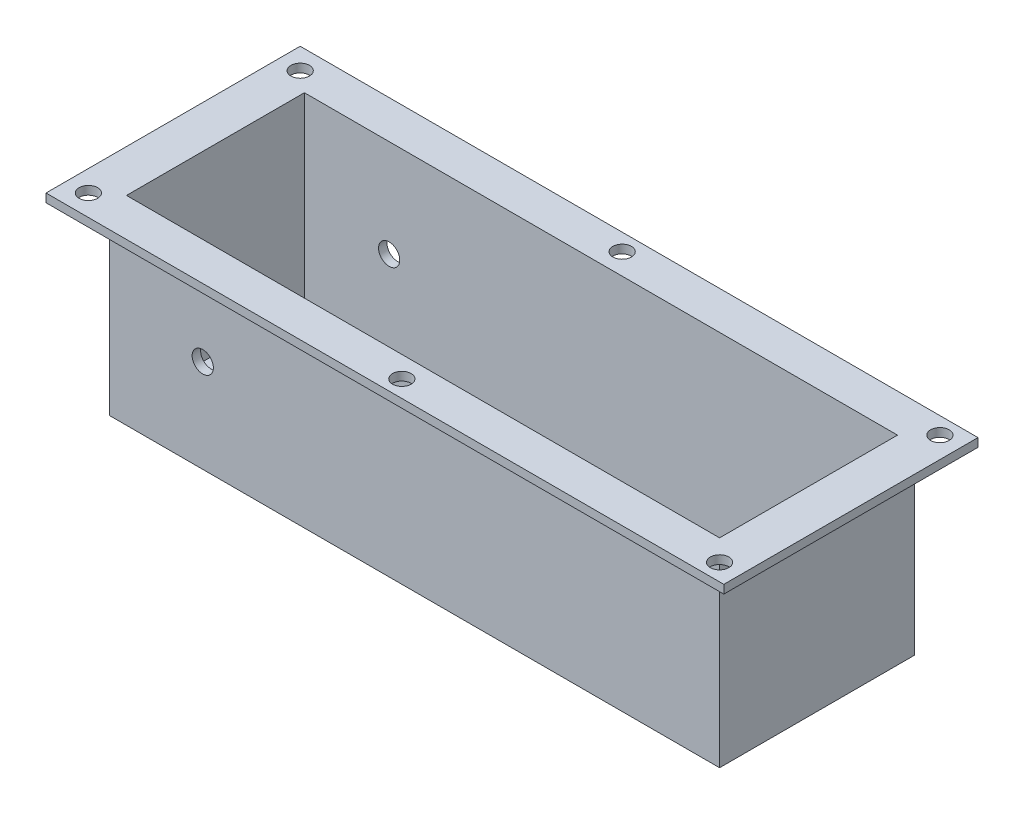
ISO-10303-21;
HEADER;
FILE_DESCRIPTION(('STEP AP214'),'2;1');
FILE_NAME('part.step','',(''),(''),'','','');
FILE_SCHEMA(('AUTOMOTIVE_DESIGN { 1 0 10303 214 1 1 1 1 }'));
ENDSEC;
DATA;
#1=APPLICATION_CONTEXT('core data for automotive mechanical design processes');
#2=APPLICATION_PROTOCOL_DEFINITION('international standard','automotive_design',2000,#1);
#3=PRODUCT_CONTEXT('',#1,'mechanical');
#4=PRODUCT('Part','Part','',(#3));
#5=PRODUCT_RELATED_PRODUCT_CATEGORY('part','',(#4));
#6=PRODUCT_DEFINITION_FORMATION('','',#4);
#7=PRODUCT_DEFINITION_CONTEXT('part definition',#1,'design');
#8=PRODUCT_DEFINITION('design','',#6,#7);
#9=PRODUCT_DEFINITION_SHAPE('','',#8);
#10=(LENGTH_UNIT() NAMED_UNIT(*) SI_UNIT(.MILLI.,.METRE.));
#11=(NAMED_UNIT(*) PLANE_ANGLE_UNIT() SI_UNIT($,.RADIAN.));
#12=(NAMED_UNIT(*) SI_UNIT($,.STERADIAN.) SOLID_ANGLE_UNIT());
#13=UNCERTAINTY_MEASURE_WITH_UNIT(LENGTH_MEASURE(1.E-05),#10,'distance_accuracy_value','');
#14=(GEOMETRIC_REPRESENTATION_CONTEXT(3) GLOBAL_UNCERTAINTY_ASSIGNED_CONTEXT((#13)) GLOBAL_UNIT_ASSIGNED_CONTEXT((#10,
#11,#12)) REPRESENTATION_CONTEXT('',''));
#15=CARTESIAN_POINT('',(0.,0.,0.));
#16=DIRECTION('',(0.,0.,1.));
#17=DIRECTION('',(1.,0.,0.));
#18=AXIS2_PLACEMENT_3D('',#15,#16,#17);
#19=CARTESIAN_POINT('',(91.44,-57.15,-29.21));
#20=DIRECTION('',(1.,0.,0.));
#21=DIRECTION('',(0.,0.,-1.));
#22=AXIS2_PLACEMENT_3D('',#19,#20,#21);
#23=PLANE('',#22);
#24=DIRECTION('',(0.,0.,-1.));
#25=VECTOR('',#24,1.);
#26=CARTESIAN_POINT('',(91.44,-2.54,-29.21));
#27=LINE('',#26,#25);
#28=CARTESIAN_POINT('',(91.44,-2.54,29.21));
#29=VERTEX_POINT('',#28);
#30=CARTESIAN_POINT('',(91.44,-2.54,-29.21));
#31=VERTEX_POINT('',#30);
#32=EDGE_CURVE('E69',#29,#31,#27,.T.);
#33=ORIENTED_EDGE('',*,*,#32,.F.);
#34=DIRECTION('',(0.,1.,0.));
#35=VECTOR('',#34,1.);
#36=CARTESIAN_POINT('',(91.44,-57.15,29.21));
#37=LINE('',#36,#35);
#38=CARTESIAN_POINT('',(91.44,-57.15,29.21));
#39=VERTEX_POINT('',#38);
#40=EDGE_CURVE('E54',#39,#29,#37,.T.);
#41=ORIENTED_EDGE('',*,*,#40,.F.);
#42=DIRECTION('',(0.,0.,-1.));
#43=VECTOR('',#42,1.);
#44=CARTESIAN_POINT('',(91.44,-57.15,-29.21));
#45=LINE('',#44,#43);
#46=CARTESIAN_POINT('',(91.44,-57.15,-29.21));
#47=VERTEX_POINT('',#46);
#48=EDGE_CURVE('E243',#39,#47,#45,.T.);
#49=ORIENTED_EDGE('',*,*,#48,.T.);
#50=DIRECTION('',(0.,1.,0.));
#51=VECTOR('',#50,1.);
#52=CARTESIAN_POINT('',(91.44,-57.15,-29.21));
#53=LINE('',#52,#51);
#54=EDGE_CURVE('E259',#47,#31,#53,.T.);
#55=ORIENTED_EDGE('',*,*,#54,.T.);
#56=EDGE_LOOP('',(#33,#41,#49,#55));
#57=FACE_BOUND('',#56,.T.);
#58=ADVANCED_FACE('F45',(#57),#23,.T.);
#59=CARTESIAN_POINT('',(-91.44,-57.15,29.21));
#60=DIRECTION('',(0.,0.,1.));
#61=DIRECTION('',(1.,0.,0.));
#62=AXIS2_PLACEMENT_3D('',#59,#60,#61);
#63=PLANE('',#62);
#64=CARTESIAN_POINT('',(-63.5,-29.21,29.21));
#65=DIRECTION('',(0.,0.,1.));
#66=DIRECTION('',(1.,0.,0.));
#67=AXIS2_PLACEMENT_3D('',#64,#65,#66);
#68=CIRCLE('',#67,3.18135);
#69=CARTESIAN_POINT('',(-60.31865,-29.21,29.21));
#70=VERTEX_POINT('',#69);
#71=EDGE_CURVE('E377',#70,#70,#68,.T.);
#72=ORIENTED_EDGE('',*,*,#71,.F.);
#73=EDGE_LOOP('',(#72));
#74=FACE_BOUND('',#73,.T.);
#75=DIRECTION('',(1.,0.,0.));
#76=VECTOR('',#75,1.);
#77=CARTESIAN_POINT('',(-91.44,-2.54,29.21));
#78=LINE('',#77,#76);
#79=CARTESIAN_POINT('',(-91.44,-2.54,29.21));
#80=VERTEX_POINT('',#79);
#81=EDGE_CURVE('E237',#80,#29,#78,.T.);
#82=ORIENTED_EDGE('',*,*,#81,.F.);
#83=DIRECTION('',(0.,1.,0.));
#84=VECTOR('',#83,1.);
#85=CARTESIAN_POINT('',(-91.44,-57.15,29.21));
#86=LINE('',#85,#84);
#87=CARTESIAN_POINT('',(-91.44,-57.15,29.21));
#88=VERTEX_POINT('',#87);
#89=EDGE_CURVE('E262',#88,#80,#86,.T.);
#90=ORIENTED_EDGE('',*,*,#89,.F.);
#91=DIRECTION('',(1.,0.,0.));
#92=VECTOR('',#91,1.);
#93=CARTESIAN_POINT('',(-91.44,-57.15,29.21));
#94=LINE('',#93,#92);
#95=EDGE_CURVE('E255',#88,#39,#94,.T.);
#96=ORIENTED_EDGE('',*,*,#95,.T.);
#97=ORIENTED_EDGE('',*,*,#40,.T.);
#98=EDGE_LOOP('',(#82,#90,#96,#97));
#99=FACE_BOUND('',#98,.T.);
#100=ADVANCED_FACE('F278',(#74,#99),#63,.T.);
#101=CARTESIAN_POINT('',(-91.44,-57.15,-29.21));
#102=DIRECTION('',(-1.,0.,0.));
#103=DIRECTION('',(0.,0.,1.));
#104=AXIS2_PLACEMENT_3D('',#101,#102,#103);
#105=PLANE('',#104);
#106=DIRECTION('',(0.,0.,1.));
#107=VECTOR('',#106,1.);
#108=CARTESIAN_POINT('',(-91.44,-2.54,-29.21));
#109=LINE('',#108,#107);
#110=CARTESIAN_POINT('',(-91.44,-2.54,-29.21));
#111=VERTEX_POINT('',#110);
#112=EDGE_CURVE('E225',#111,#80,#109,.T.);
#113=ORIENTED_EDGE('',*,*,#112,.F.);
#114=DIRECTION('',(0.,1.,0.));
#115=VECTOR('',#114,1.);
#116=CARTESIAN_POINT('',(-91.44,-57.15,-29.21));
#117=LINE('',#116,#115);
#118=CARTESIAN_POINT('',(-91.44,-57.15,-29.21));
#119=VERTEX_POINT('',#118);
#120=EDGE_CURVE('E266',#119,#111,#117,.T.);
#121=ORIENTED_EDGE('',*,*,#120,.F.);
#122=DIRECTION('',(0.,0.,1.));
#123=VECTOR('',#122,1.);
#124=CARTESIAN_POINT('',(-91.44,-57.15,-29.21));
#125=LINE('',#124,#123);
#126=EDGE_CURVE('E251',#119,#88,#125,.T.);
#127=ORIENTED_EDGE('',*,*,#126,.T.);
#128=ORIENTED_EDGE('',*,*,#89,.T.);
#129=EDGE_LOOP('',(#113,#121,#127,#128));
#130=FACE_BOUND('',#129,.T.);
#131=ADVANCED_FACE('F280',(#130),#105,.T.);
#132=CARTESIAN_POINT('',(-91.44,-57.15,-29.21));
#133=DIRECTION('',(0.,0.,-1.));
#134=DIRECTION('',(-1.,0.,0.));
#135=AXIS2_PLACEMENT_3D('',#132,#133,#134);
#136=PLANE('',#135);
#137=CARTESIAN_POINT('',(-63.5,-29.21,-29.21));
#138=DIRECTION('',(0.,0.,-1.));
#139=DIRECTION('',(-1.,0.,0.));
#140=AXIS2_PLACEMENT_3D('',#137,#138,#139);
#141=CIRCLE('',#140,3.18135);
#142=CARTESIAN_POINT('',(-66.68135,-29.21,-29.21));
#143=VERTEX_POINT('',#142);
#144=EDGE_CURVE('E382',#143,#143,#141,.T.);
#145=ORIENTED_EDGE('',*,*,#144,.F.);
#146=EDGE_LOOP('',(#145));
#147=FACE_BOUND('',#146,.T.);
#148=DIRECTION('',(-1.,0.,0.));
#149=VECTOR('',#148,1.);
#150=CARTESIAN_POINT('',(-91.44,-2.54,-29.21));
#151=LINE('',#150,#149);
#152=EDGE_CURVE('E11',#31,#111,#151,.T.);
#153=ORIENTED_EDGE('',*,*,#152,.F.);
#154=ORIENTED_EDGE('',*,*,#54,.F.);
#155=DIRECTION('',(-1.,0.,0.));
#156=VECTOR('',#155,1.);
#157=CARTESIAN_POINT('',(-91.44,-57.15,-29.21));
#158=LINE('',#157,#156);
#159=EDGE_CURVE('E247',#47,#119,#158,.T.);
#160=ORIENTED_EDGE('',*,*,#159,.T.);
#161=ORIENTED_EDGE('',*,*,#120,.T.);
#162=EDGE_LOOP('',(#153,#154,#160,#161));
#163=FACE_BOUND('',#162,.T.);
#164=ADVANCED_FACE('F285',(#147,#163),#136,.T.);
#165=CARTESIAN_POINT('',(0.,-57.15,0.));
#166=DIRECTION('',(0.,1.,0.));
#167=DIRECTION('',(0.,0.,1.));
#168=AXIS2_PLACEMENT_3D('',#165,#166,#167);
#169=PLANE('',#168);
#170=ORIENTED_EDGE('',*,*,#48,.F.);
#171=ORIENTED_EDGE('',*,*,#95,.F.);
#172=ORIENTED_EDGE('',*,*,#126,.F.);
#173=ORIENTED_EDGE('',*,*,#159,.F.);
#174=EDGE_LOOP('',(#170,#171,#172,#173));
#175=FACE_BOUND('',#174,.T.);
#176=ADVANCED_FACE('F284',(#175),#169,.F.);
#177=CARTESIAN_POINT('',(101.6,-2.54,38.1));
#178=DIRECTION('',(1.,0.,0.));
#179=DIRECTION('',(0.,0.,-1.));
#180=AXIS2_PLACEMENT_3D('',#177,#178,#179);
#181=PLANE('',#180);
#182=DIRECTION('',(0.,0.,-1.));
#183=VECTOR('',#182,1.);
#184=CARTESIAN_POINT('',(101.6,0.,38.1));
#185=LINE('',#184,#183);
#186=CARTESIAN_POINT('',(101.6,0.,38.1));
#187=VERTEX_POINT('',#186);
#188=CARTESIAN_POINT('',(101.6,0.,-38.1));
#189=VERTEX_POINT('',#188);
#190=EDGE_CURVE('E184',#187,#189,#185,.T.);
#191=ORIENTED_EDGE('',*,*,#190,.F.);
#192=DIRECTION('',(0.,1.,0.));
#193=VECTOR('',#192,1.);
#194=CARTESIAN_POINT('',(101.6,-2.54,38.1));
#195=LINE('',#194,#193);
#196=CARTESIAN_POINT('',(101.6,-2.54,38.1));
#197=VERTEX_POINT('',#196);
#198=EDGE_CURVE('E222',#197,#187,#195,.T.);
#199=ORIENTED_EDGE('',*,*,#198,.F.);
#200=DIRECTION('',(0.,0.,-1.));
#201=VECTOR('',#200,1.);
#202=CARTESIAN_POINT('',(101.6,-2.54,38.1));
#203=LINE('',#202,#201);
#204=CARTESIAN_POINT('',(101.6,-2.54,-38.1));
#205=VERTEX_POINT('',#204);
#206=EDGE_CURVE('E190',#197,#205,#203,.T.);
#207=ORIENTED_EDGE('',*,*,#206,.T.);
#208=DIRECTION('',(0.,1.,0.));
#209=VECTOR('',#208,1.);
#210=CARTESIAN_POINT('',(101.6,-2.54,-38.1));
#211=LINE('',#210,#209);
#212=EDGE_CURVE('E207',#205,#189,#211,.T.);
#213=ORIENTED_EDGE('',*,*,#212,.T.);
#214=EDGE_LOOP('',(#191,#199,#207,#213));
#215=FACE_BOUND('',#214,.T.);
#216=ADVANCED_FACE('F293',(#215),#181,.T.);
#217=CARTESIAN_POINT('',(-101.6,-2.54,38.1));
#218=DIRECTION('',(0.,0.,1.));
#219=DIRECTION('',(1.,0.,0.));
#220=AXIS2_PLACEMENT_3D('',#217,#218,#219);
#221=PLANE('',#220);
#222=DIRECTION('',(1.,0.,0.));
#223=VECTOR('',#222,1.);
#224=CARTESIAN_POINT('',(-101.6,0.,38.1));
#225=LINE('',#224,#223);
#226=CARTESIAN_POINT('',(-101.6,0.,38.1));
#227=VERTEX_POINT('',#226);
#228=EDGE_CURVE('E195',#227,#187,#225,.T.);
#229=ORIENTED_EDGE('',*,*,#228,.F.);
#230=DIRECTION('',(0.,1.,0.));
#231=VECTOR('',#230,1.);
#232=CARTESIAN_POINT('',(-101.6,-2.54,38.1));
#233=LINE('',#232,#231);
#234=CARTESIAN_POINT('',(-101.6,-2.54,38.1));
#235=VERTEX_POINT('',#234);
#236=EDGE_CURVE('E226',#235,#227,#233,.T.);
#237=ORIENTED_EDGE('',*,*,#236,.F.);
#238=DIRECTION('',(1.,0.,0.));
#239=VECTOR('',#238,1.);
#240=CARTESIAN_POINT('',(-101.6,-2.54,38.1));
#241=LINE('',#240,#239);
#242=EDGE_CURVE('E203',#235,#197,#241,.T.);
#243=ORIENTED_EDGE('',*,*,#242,.T.);
#244=ORIENTED_EDGE('',*,*,#198,.T.);
#245=EDGE_LOOP('',(#229,#237,#243,#244));
#246=FACE_BOUND('',#245,.T.);
#247=ADVANCED_FACE('F314',(#246),#221,.T.);
#248=CARTESIAN_POINT('',(-101.6,-2.54,38.1));
#249=DIRECTION('',(-1.,0.,0.));
#250=DIRECTION('',(0.,0.,1.));
#251=AXIS2_PLACEMENT_3D('',#248,#249,#250);
#252=PLANE('',#251);
#253=DIRECTION('',(0.,0.,1.));
#254=VECTOR('',#253,1.);
#255=CARTESIAN_POINT('',(-101.6,0.,38.1));
#256=LINE('',#255,#254);
#257=CARTESIAN_POINT('',(-101.6,0.,-38.1));
#258=VERTEX_POINT('',#257);
#259=EDGE_CURVE('E215',#258,#227,#256,.T.);
#260=ORIENTED_EDGE('',*,*,#259,.F.);
#261=DIRECTION('',(0.,1.,0.));
#262=VECTOR('',#261,1.);
#263=CARTESIAN_POINT('',(-101.6,-2.54,-38.1));
#264=LINE('',#263,#262);
#265=CARTESIAN_POINT('',(-101.6,-2.54,-38.1));
#266=VERTEX_POINT('',#265);
#267=EDGE_CURVE('E229',#266,#258,#264,.T.);
#268=ORIENTED_EDGE('',*,*,#267,.F.);
#269=DIRECTION('',(0.,0.,1.));
#270=VECTOR('',#269,1.);
#271=CARTESIAN_POINT('',(-101.6,-2.54,38.1));
#272=LINE('',#271,#270);
#273=EDGE_CURVE('E199',#266,#235,#272,.T.);
#274=ORIENTED_EDGE('',*,*,#273,.T.);
#275=ORIENTED_EDGE('',*,*,#236,.T.);
#276=EDGE_LOOP('',(#260,#268,#274,#275));
#277=FACE_BOUND('',#276,.T.);
#278=ADVANCED_FACE('F319',(#277),#252,.T.);
#279=CARTESIAN_POINT('',(-101.6,-2.54,-38.1));
#280=DIRECTION('',(0.,0.,-1.));
#281=DIRECTION('',(-1.,0.,0.));
#282=AXIS2_PLACEMENT_3D('',#279,#280,#281);
#283=PLANE('',#282);
#284=DIRECTION('',(-1.,0.,0.));
#285=VECTOR('',#284,1.);
#286=CARTESIAN_POINT('',(-101.6,0.,-38.1));
#287=LINE('',#286,#285);
#288=EDGE_CURVE('E211',#189,#258,#287,.T.);
#289=ORIENTED_EDGE('',*,*,#288,.F.);
#290=ORIENTED_EDGE('',*,*,#212,.F.);
#291=DIRECTION('',(-1.,0.,0.));
#292=VECTOR('',#291,1.);
#293=CARTESIAN_POINT('',(-101.6,-2.54,-38.1));
#294=LINE('',#293,#292);
#295=EDGE_CURVE('E194',#205,#266,#294,.T.);
#296=ORIENTED_EDGE('',*,*,#295,.T.);
#297=ORIENTED_EDGE('',*,*,#267,.T.);
#298=EDGE_LOOP('',(#289,#290,#296,#297));
#299=FACE_BOUND('',#298,.T.);
#300=ADVANCED_FACE('F316',(#299),#283,.T.);
#301=CARTESIAN_POINT('',(0.,-2.54,0.));
#302=DIRECTION('',(0.,-1.,0.));
#303=DIRECTION('',(0.,0.,-1.));
#304=AXIS2_PLACEMENT_3D('',#301,#302,#303);
#305=PLANE('',#304);
#306=CARTESIAN_POINT('',(-95.25,-2.54,31.75));
#307=DIRECTION('',(0.,-1.,0.));
#308=DIRECTION('',(0.,0.,-1.));
#309=AXIS2_PLACEMENT_3D('',#306,#307,#308);
#310=CIRCLE('',#309,2.7813);
#311=CARTESIAN_POINT('',(-95.25,-2.54,28.9687));
#312=VERTEX_POINT('',#311);
#313=EDGE_CURVE('E166',#312,#312,#310,.T.);
#314=ORIENTED_EDGE('',*,*,#313,.F.);
#315=EDGE_LOOP('',(#314));
#316=FACE_BOUND('',#315,.T.);
#317=CARTESIAN_POINT('',(0.,-2.54,33.02));
#318=DIRECTION('',(0.,-1.,0.));
#319=DIRECTION('',(0.,0.,-1.));
#320=AXIS2_PLACEMENT_3D('',#317,#318,#319);
#321=CIRCLE('',#320,2.7813);
#322=CARTESIAN_POINT('',(0.,-2.54,30.2387));
#323=VERTEX_POINT('',#322);
#324=EDGE_CURVE('E431',#323,#323,#321,.T.);
#325=ORIENTED_EDGE('',*,*,#324,.F.);
#326=EDGE_LOOP('',(#325));
#327=FACE_BOUND('',#326,.T.);
#328=CARTESIAN_POINT('',(95.25,-2.54,33.02));
#329=DIRECTION('',(0.,-1.,0.));
#330=DIRECTION('',(0.,0.,-1.));
#331=AXIS2_PLACEMENT_3D('',#328,#329,#330);
#332=CIRCLE('',#331,2.78129999999999);
#333=CARTESIAN_POINT('',(95.25,-2.54,30.2387));
#334=VERTEX_POINT('',#333);
#335=EDGE_CURVE('E428',#334,#334,#332,.T.);
#336=ORIENTED_EDGE('',*,*,#335,.F.);
#337=EDGE_LOOP('',(#336));
#338=FACE_BOUND('',#337,.T.);
#339=CARTESIAN_POINT('',(95.25,-2.54,-33.02));
#340=DIRECTION('',(0.,-1.,0.));
#341=DIRECTION('',(0.,0.,-1.));
#342=AXIS2_PLACEMENT_3D('',#339,#340,#341);
#343=CIRCLE('',#342,2.78129999999999);
#344=CARTESIAN_POINT('',(95.25,-2.54,-35.8013));
#345=VERTEX_POINT('',#344);
#346=EDGE_CURVE('E424',#345,#345,#343,.T.);
#347=ORIENTED_EDGE('',*,*,#346,.F.);
#348=EDGE_LOOP('',(#347));
#349=FACE_BOUND('',#348,.T.);
#350=CARTESIAN_POINT('',(0.,-2.54,-33.02));
#351=DIRECTION('',(0.,-1.,0.));
#352=DIRECTION('',(0.,0.,-1.));
#353=AXIS2_PLACEMENT_3D('',#350,#351,#352);
#354=CIRCLE('',#353,2.7813);
#355=CARTESIAN_POINT('',(0.,-2.54,-35.8013));
#356=VERTEX_POINT('',#355);
#357=EDGE_CURVE('E420',#356,#356,#354,.T.);
#358=ORIENTED_EDGE('',*,*,#357,.F.);
#359=EDGE_LOOP('',(#358));
#360=FACE_BOUND('',#359,.T.);
#361=CARTESIAN_POINT('',(-95.25,-2.54,-31.75));
#362=DIRECTION('',(0.,-1.,0.));
#363=DIRECTION('',(0.,0.,-1.));
#364=AXIS2_PLACEMENT_3D('',#361,#362,#363);
#365=CIRCLE('',#364,2.78129999999999);
#366=CARTESIAN_POINT('',(-95.25,-2.54,-34.5313));
#367=VERTEX_POINT('',#366);
#368=EDGE_CURVE('E416',#367,#367,#365,.T.);
#369=ORIENTED_EDGE('',*,*,#368,.F.);
#370=EDGE_LOOP('',(#369));
#371=FACE_BOUND('',#370,.T.);
#372=ORIENTED_EDGE('',*,*,#81,.T.);
#373=ORIENTED_EDGE('',*,*,#32,.T.);
#374=ORIENTED_EDGE('',*,*,#152,.T.);
#375=ORIENTED_EDGE('',*,*,#112,.T.);
#376=EDGE_LOOP('',(#372,#373,#374,#375));
#377=FACE_BOUND('',#376,.T.);
#378=ORIENTED_EDGE('',*,*,#206,.F.);
#379=ORIENTED_EDGE('',*,*,#242,.F.);
#380=ORIENTED_EDGE('',*,*,#273,.F.);
#381=ORIENTED_EDGE('',*,*,#295,.F.);
#382=EDGE_LOOP('',(#378,#379,#380,#381));
#383=FACE_BOUND('',#382,.T.);
#384=ADVANCED_FACE('F274',(#316,#327,#338,#349,#360,#371,#377,#383),#305,.T.);
#385=CARTESIAN_POINT('',(0.,0.,0.));
#386=DIRECTION('',(0.,1.,0.));
#387=DIRECTION('',(0.,0.,1.));
#388=AXIS2_PLACEMENT_3D('',#385,#386,#387);
#389=PLANE('',#388);
#390=CARTESIAN_POINT('',(-95.25,0.,31.75));
#391=DIRECTION('',(0.,1.,0.));
#392=DIRECTION('',(0.,0.,-1.));
#393=AXIS2_PLACEMENT_3D('',#390,#391,#392);
#394=CIRCLE('',#393,2.7813);
#395=CARTESIAN_POINT('',(-95.25,0.,28.9687));
#396=VERTEX_POINT('',#395);
#397=EDGE_CURVE('E392',#396,#396,#394,.T.);
#398=ORIENTED_EDGE('',*,*,#397,.F.);
#399=EDGE_LOOP('',(#398));
#400=FACE_BOUND('',#399,.T.);
#401=CARTESIAN_POINT('',(0.,0.,33.02));
#402=DIRECTION('',(0.,1.,0.));
#403=DIRECTION('',(0.,0.,-1.));
#404=AXIS2_PLACEMENT_3D('',#401,#402,#403);
#405=CIRCLE('',#404,2.7813);
#406=CARTESIAN_POINT('',(0.,0.,30.2387));
#407=VERTEX_POINT('',#406);
#408=EDGE_CURVE('E406',#407,#407,#405,.T.);
#409=ORIENTED_EDGE('',*,*,#408,.F.);
#410=EDGE_LOOP('',(#409));
#411=FACE_BOUND('',#410,.T.);
#412=CARTESIAN_POINT('',(95.25,0.,33.02));
#413=DIRECTION('',(0.,1.,0.));
#414=DIRECTION('',(0.,0.,-1.));
#415=AXIS2_PLACEMENT_3D('',#412,#413,#414);
#416=CIRCLE('',#415,2.78129999999999);
#417=CARTESIAN_POINT('',(95.25,0.,30.2387));
#418=VERTEX_POINT('',#417);
#419=EDGE_CURVE('E402',#418,#418,#416,.T.);
#420=ORIENTED_EDGE('',*,*,#419,.F.);
#421=EDGE_LOOP('',(#420));
#422=FACE_BOUND('',#421,.T.);
#423=CARTESIAN_POINT('',(95.25,0.,-33.02));
#424=DIRECTION('',(0.,1.,0.));
#425=DIRECTION('',(0.,0.,1.));
#426=AXIS2_PLACEMENT_3D('',#423,#424,#425);
#427=CIRCLE('',#426,2.78129999999999);
#428=CARTESIAN_POINT('',(95.25,0.,-30.2387));
#429=VERTEX_POINT('',#428);
#430=EDGE_CURVE('E398',#429,#429,#427,.T.);
#431=ORIENTED_EDGE('',*,*,#430,.F.);
#432=EDGE_LOOP('',(#431));
#433=FACE_BOUND('',#432,.T.);
#434=CARTESIAN_POINT('',(0.,0.,-33.02));
#435=DIRECTION('',(0.,1.,0.));
#436=DIRECTION('',(0.,0.,1.));
#437=AXIS2_PLACEMENT_3D('',#434,#435,#436);
#438=CIRCLE('',#437,2.7813);
#439=CARTESIAN_POINT('',(0.,0.,-30.2387));
#440=VERTEX_POINT('',#439);
#441=EDGE_CURVE('E393',#440,#440,#438,.T.);
#442=ORIENTED_EDGE('',*,*,#441,.F.);
#443=EDGE_LOOP('',(#442));
#444=FACE_BOUND('',#443,.T.);
#445=CARTESIAN_POINT('',(-95.25,0.,-31.75));
#446=DIRECTION('',(0.,1.,0.));
#447=DIRECTION('',(0.,0.,1.));
#448=AXIS2_PLACEMENT_3D('',#445,#446,#447);
#449=CIRCLE('',#448,2.78129999999999);
#450=CARTESIAN_POINT('',(-95.25,0.,-28.9687));
#451=VERTEX_POINT('',#450);
#452=EDGE_CURVE('E397',#451,#451,#449,.T.);
#453=ORIENTED_EDGE('',*,*,#452,.F.);
#454=EDGE_LOOP('',(#453));
#455=FACE_BOUND('',#454,.T.);
#456=DIRECTION('',(0.,0.,-1.));
#457=VECTOR('',#456,1.);
#458=CARTESIAN_POINT('',(88.9,0.,26.67));
#459=LINE('',#458,#457);
#460=CARTESIAN_POINT('',(88.9,0.,26.67));
#461=VERTEX_POINT('',#460);
#462=CARTESIAN_POINT('',(88.9,0.,-26.67));
#463=VERTEX_POINT('',#462);
#464=EDGE_CURVE('E61',#461,#463,#459,.T.);
#465=ORIENTED_EDGE('',*,*,#464,.F.);
#466=DIRECTION('',(1.,0.,0.));
#467=VECTOR('',#466,1.);
#468=CARTESIAN_POINT('',(-88.9,0.,26.67));
#469=LINE('',#468,#467);
#470=CARTESIAN_POINT('',(-88.9,0.,26.67));
#471=VERTEX_POINT('',#470);
#472=EDGE_CURVE('E159',#471,#461,#469,.T.);
#473=ORIENTED_EDGE('',*,*,#472,.F.);
#474=DIRECTION('',(0.,0.,1.));
#475=VECTOR('',#474,1.);
#476=CARTESIAN_POINT('',(-88.9,0.,26.67));
#477=LINE('',#476,#475);
#478=CARTESIAN_POINT('',(-88.9,0.,-26.67));
#479=VERTEX_POINT('',#478);
#480=EDGE_CURVE('E163',#479,#471,#477,.T.);
#481=ORIENTED_EDGE('',*,*,#480,.F.);
#482=DIRECTION('',(-1.,0.,0.));
#483=VECTOR('',#482,1.);
#484=CARTESIAN_POINT('',(-88.9,0.,-26.67));
#485=LINE('',#484,#483);
#486=EDGE_CURVE('E175',#463,#479,#485,.T.);
#487=ORIENTED_EDGE('',*,*,#486,.F.);
#488=EDGE_LOOP('',(#465,#473,#481,#487));
#489=FACE_BOUND('',#488,.T.);
#490=ORIENTED_EDGE('',*,*,#190,.T.);
#491=ORIENTED_EDGE('',*,*,#288,.T.);
#492=ORIENTED_EDGE('',*,*,#259,.T.);
#493=ORIENTED_EDGE('',*,*,#228,.T.);
#494=EDGE_LOOP('',(#490,#491,#492,#493));
#495=FACE_BOUND('',#494,.T.);
#496=ADVANCED_FACE('F308',(#400,#411,#422,#433,#444,#455,#489,#495),#389,.T.);
#497=CARTESIAN_POINT('',(88.9,-54.61,26.67));
#498=DIRECTION('',(1.,0.,0.));
#499=DIRECTION('',(0.,0.,-1.));
#500=AXIS2_PLACEMENT_3D('',#497,#498,#499);
#501=PLANE('',#500);
#502=ORIENTED_EDGE('',*,*,#464,.T.);
#503=DIRECTION('',(0.,1.,0.));
#504=VECTOR('',#503,1.);
#505=CARTESIAN_POINT('',(88.9,-54.61,-26.67));
#506=LINE('',#505,#504);
#507=CARTESIAN_POINT('',(88.9,-54.61,-26.67));
#508=VERTEX_POINT('',#507);
#509=EDGE_CURVE('E134',#508,#463,#506,.T.);
#510=ORIENTED_EDGE('',*,*,#509,.F.);
#511=DIRECTION('',(0.,0.,-1.));
#512=VECTOR('',#511,1.);
#513=CARTESIAN_POINT('',(88.9,-54.61,26.67));
#514=LINE('',#513,#512);
#515=CARTESIAN_POINT('',(88.9,-54.61,26.67));
#516=VERTEX_POINT('',#515);
#517=EDGE_CURVE('E138',#516,#508,#514,.T.);
#518=ORIENTED_EDGE('',*,*,#517,.F.);
#519=DIRECTION('',(0.,1.,0.));
#520=VECTOR('',#519,1.);
#521=CARTESIAN_POINT('',(88.9,-54.61,26.67));
#522=LINE('',#521,#520);
#523=EDGE_CURVE('E181',#516,#461,#522,.T.);
#524=ORIENTED_EDGE('',*,*,#523,.T.);
#525=EDGE_LOOP('',(#502,#510,#518,#524));
#526=FACE_BOUND('',#525,.T.);
#527=ADVANCED_FACE('F136',(#526),#501,.F.);
#528=CARTESIAN_POINT('',(-88.9,-54.61,26.67));
#529=DIRECTION('',(0.,0.,1.));
#530=DIRECTION('',(1.,0.,0.));
#531=AXIS2_PLACEMENT_3D('',#528,#529,#530);
#532=PLANE('',#531);
#533=CARTESIAN_POINT('',(-63.5,-29.21,26.67));
#534=DIRECTION('',(0.,0.,1.));
#535=DIRECTION('',(1.,0.,0.));
#536=AXIS2_PLACEMENT_3D('',#533,#534,#535);
#537=CIRCLE('',#536,3.18135);
#538=CARTESIAN_POINT('',(-60.31865,-29.21,26.67));
#539=VERTEX_POINT('',#538);
#540=EDGE_CURVE('E380',#539,#539,#537,.T.);
#541=ORIENTED_EDGE('',*,*,#540,.T.);
#542=EDGE_LOOP('',(#541));
#543=FACE_BOUND('',#542,.T.);
#544=ORIENTED_EDGE('',*,*,#472,.T.);
#545=ORIENTED_EDGE('',*,*,#523,.F.);
#546=DIRECTION('',(1.,0.,0.));
#547=VECTOR('',#546,1.);
#548=CARTESIAN_POINT('',(-88.9,-54.61,26.67));
#549=LINE('',#548,#547);
#550=CARTESIAN_POINT('',(-88.9,-54.61,26.67));
#551=VERTEX_POINT('',#550);
#552=EDGE_CURVE('E145',#551,#516,#549,.T.);
#553=ORIENTED_EDGE('',*,*,#552,.F.);
#554=DIRECTION('',(0.,1.,0.));
#555=VECTOR('',#554,1.);
#556=CARTESIAN_POINT('',(-88.9,-54.61,26.67));
#557=LINE('',#556,#555);
#558=EDGE_CURVE('E185',#551,#471,#557,.T.);
#559=ORIENTED_EDGE('',*,*,#558,.T.);
#560=EDGE_LOOP('',(#544,#545,#553,#559));
#561=FACE_BOUND('',#560,.T.);
#562=ADVANCED_FACE('F332',(#543,#561),#532,.F.);
#563=CARTESIAN_POINT('',(-88.9,-54.61,26.67));
#564=DIRECTION('',(-1.,0.,0.));
#565=DIRECTION('',(0.,0.,1.));
#566=AXIS2_PLACEMENT_3D('',#563,#564,#565);
#567=PLANE('',#566);
#568=ORIENTED_EDGE('',*,*,#480,.T.);
#569=ORIENTED_EDGE('',*,*,#558,.F.);
#570=DIRECTION('',(0.,0.,1.));
#571=VECTOR('',#570,1.);
#572=CARTESIAN_POINT('',(-88.9,-54.61,26.67));
#573=LINE('',#572,#571);
#574=CARTESIAN_POINT('',(-88.9,-54.61,-26.67));
#575=VERTEX_POINT('',#574);
#576=EDGE_CURVE('E154',#575,#551,#573,.T.);
#577=ORIENTED_EDGE('',*,*,#576,.F.);
#578=DIRECTION('',(0.,1.,0.));
#579=VECTOR('',#578,1.);
#580=CARTESIAN_POINT('',(-88.9,-54.61,-26.67));
#581=LINE('',#580,#579);
#582=EDGE_CURVE('E144',#575,#479,#581,.T.);
#583=ORIENTED_EDGE('',*,*,#582,.T.);
#584=EDGE_LOOP('',(#568,#569,#577,#583));
#585=FACE_BOUND('',#584,.T.);
#586=ADVANCED_FACE('F335',(#585),#567,.F.);
#587=CARTESIAN_POINT('',(-88.9,-54.61,-26.67));
#588=DIRECTION('',(0.,0.,-1.));
#589=DIRECTION('',(-1.,0.,0.));
#590=AXIS2_PLACEMENT_3D('',#587,#588,#589);
#591=PLANE('',#590);
#592=CARTESIAN_POINT('',(-63.5,-29.21,-26.67));
#593=DIRECTION('',(0.,0.,-1.));
#594=DIRECTION('',(-1.,0.,0.));
#595=AXIS2_PLACEMENT_3D('',#592,#593,#594);
#596=CIRCLE('',#595,3.18135);
#597=CARTESIAN_POINT('',(-66.68135,-29.21,-26.67));
#598=VERTEX_POINT('',#597);
#599=EDGE_CURVE('E48',#598,#598,#596,.T.);
#600=ORIENTED_EDGE('',*,*,#599,.T.);
#601=EDGE_LOOP('',(#600));
#602=FACE_BOUND('',#601,.T.);
#603=ORIENTED_EDGE('',*,*,#486,.T.);
#604=ORIENTED_EDGE('',*,*,#582,.F.);
#605=DIRECTION('',(-1.,0.,0.));
#606=VECTOR('',#605,1.);
#607=CARTESIAN_POINT('',(-88.9,-54.61,-26.67));
#608=LINE('',#607,#606);
#609=EDGE_CURVE('E148',#508,#575,#608,.T.);
#610=ORIENTED_EDGE('',*,*,#609,.F.);
#611=ORIENTED_EDGE('',*,*,#509,.T.);
#612=EDGE_LOOP('',(#603,#604,#610,#611));
#613=FACE_BOUND('',#612,.T.);
#614=ADVANCED_FACE('F149',(#602,#613),#591,.F.);
#615=CARTESIAN_POINT('',(0.,-54.61,0.));
#616=DIRECTION('',(0.,-1.,0.));
#617=DIRECTION('',(0.,0.,-1.));
#618=AXIS2_PLACEMENT_3D('',#615,#616,#617);
#619=PLANE('',#618);
#620=ORIENTED_EDGE('',*,*,#517,.T.);
#621=ORIENTED_EDGE('',*,*,#609,.T.);
#622=ORIENTED_EDGE('',*,*,#576,.T.);
#623=ORIENTED_EDGE('',*,*,#552,.T.);
#624=EDGE_LOOP('',(#620,#621,#622,#623));
#625=FACE_BOUND('',#624,.T.);
#626=ADVANCED_FACE('F156',(#625),#619,.F.);
#627=CARTESIAN_POINT('',(-95.25,-53.34,-31.75));
#628=DIRECTION('',(0.,1.,0.));
#629=DIRECTION('',(0.,0.,1.));
#630=AXIS2_PLACEMENT_3D('',#627,#628,#629);
#631=CYLINDRICAL_SURFACE('',#630,2.78129999999999);
#632=ORIENTED_EDGE('',*,*,#368,.T.);
#633=EDGE_LOOP('',(#632));
#634=FACE_BOUND('',#633,.T.);
#635=ORIENTED_EDGE('',*,*,#452,.T.);
#636=EDGE_LOOP('',(#635));
#637=FACE_BOUND('',#636,.T.);
#638=ADVANCED_FACE('F344',(#634,#637),#631,.F.);
#639=CARTESIAN_POINT('',(0.,-53.34,-33.02));
#640=DIRECTION('',(0.,1.,0.));
#641=DIRECTION('',(0.,0.,1.));
#642=AXIS2_PLACEMENT_3D('',#639,#640,#641);
#643=CYLINDRICAL_SURFACE('',#642,2.7813);
#644=ORIENTED_EDGE('',*,*,#357,.T.);
#645=EDGE_LOOP('',(#644));
#646=FACE_BOUND('',#645,.T.);
#647=ORIENTED_EDGE('',*,*,#441,.T.);
#648=EDGE_LOOP('',(#647));
#649=FACE_BOUND('',#648,.T.);
#650=ADVANCED_FACE('F347',(#646,#649),#643,.F.);
#651=CARTESIAN_POINT('',(95.25,-53.34,-33.02));
#652=DIRECTION('',(0.,1.,0.));
#653=DIRECTION('',(0.,0.,1.));
#654=AXIS2_PLACEMENT_3D('',#651,#652,#653);
#655=CYLINDRICAL_SURFACE('',#654,2.78129999999999);
#656=ORIENTED_EDGE('',*,*,#346,.T.);
#657=EDGE_LOOP('',(#656));
#658=FACE_BOUND('',#657,.T.);
#659=ORIENTED_EDGE('',*,*,#430,.T.);
#660=EDGE_LOOP('',(#659));
#661=FACE_BOUND('',#660,.T.);
#662=ADVANCED_FACE('F360',(#658,#661),#655,.F.);
#663=CARTESIAN_POINT('',(95.25,-53.34,33.02));
#664=DIRECTION('',(0.,1.,0.));
#665=DIRECTION('',(0.,0.,1.));
#666=AXIS2_PLACEMENT_3D('',#663,#664,#665);
#667=CYLINDRICAL_SURFACE('',#666,2.78129999999999);
#668=ORIENTED_EDGE('',*,*,#335,.T.);
#669=EDGE_LOOP('',(#668));
#670=FACE_BOUND('',#669,.T.);
#671=ORIENTED_EDGE('',*,*,#419,.T.);
#672=EDGE_LOOP('',(#671));
#673=FACE_BOUND('',#672,.T.);
#674=ADVANCED_FACE('F356',(#670,#673),#667,.F.);
#675=CARTESIAN_POINT('',(0.,-53.34,33.02));
#676=DIRECTION('',(0.,1.,0.));
#677=DIRECTION('',(0.,0.,1.));
#678=AXIS2_PLACEMENT_3D('',#675,#676,#677);
#679=CYLINDRICAL_SURFACE('',#678,2.7813);
#680=ORIENTED_EDGE('',*,*,#324,.T.);
#681=EDGE_LOOP('',(#680));
#682=FACE_BOUND('',#681,.T.);
#683=ORIENTED_EDGE('',*,*,#408,.T.);
#684=EDGE_LOOP('',(#683));
#685=FACE_BOUND('',#684,.T.);
#686=ADVANCED_FACE('F352',(#682,#685),#679,.F.);
#687=CARTESIAN_POINT('',(-95.25,-53.34,31.75));
#688=DIRECTION('',(0.,1.,0.));
#689=DIRECTION('',(0.,0.,1.));
#690=AXIS2_PLACEMENT_3D('',#687,#688,#689);
#691=CYLINDRICAL_SURFACE('',#690,2.7813);
#692=ORIENTED_EDGE('',*,*,#313,.T.);
#693=EDGE_LOOP('',(#692));
#694=FACE_BOUND('',#693,.T.);
#695=ORIENTED_EDGE('',*,*,#397,.T.);
#696=EDGE_LOOP('',(#695));
#697=FACE_BOUND('',#696,.T.);
#698=ADVANCED_FACE('F349',(#694,#697),#691,.F.);
#699=CARTESIAN_POINT('',(-63.5,-29.21,-38.1));
#700=DIRECTION('',(0.,0.,1.));
#701=DIRECTION('',(1.,0.,0.));
#702=AXIS2_PLACEMENT_3D('',#699,#700,#701);
#703=CYLINDRICAL_SURFACE('',#702,3.18135);
#704=ORIENTED_EDGE('',*,*,#144,.T.);
#705=EDGE_LOOP('',(#704));
#706=FACE_BOUND('',#705,.T.);
#707=ORIENTED_EDGE('',*,*,#599,.F.);
#708=EDGE_LOOP('',(#707));
#709=FACE_BOUND('',#708,.T.);
#710=ADVANCED_FACE('F351',(#706,#709),#703,.F.);
#711=ORIENTED_EDGE('',*,*,#71,.T.);
#712=EDGE_LOOP('',(#711));
#713=FACE_BOUND('',#712,.T.);
#714=ORIENTED_EDGE('',*,*,#540,.F.);
#715=EDGE_LOOP('',(#714));
#716=FACE_BOUND('',#715,.T.);
#717=ADVANCED_FACE('F368',(#713,#716),#703,.F.);
#718=CLOSED_SHELL('',(#58,#100,#131,#164,#176,#216,#247,#278,#300,#384,#496,#527,#562,#586,#614,
#626,#638,#650,#662,#674,#686,#698,#710,#717));
#719=MANIFOLD_SOLID_BREP('B2',#718);
#720=ADVANCED_BREP_SHAPE_REPRESENTATION('',(#18,#719),#14);
#721=SHAPE_DEFINITION_REPRESENTATION(#9,#720);
ENDSEC;
END-ISO-10303-21;
